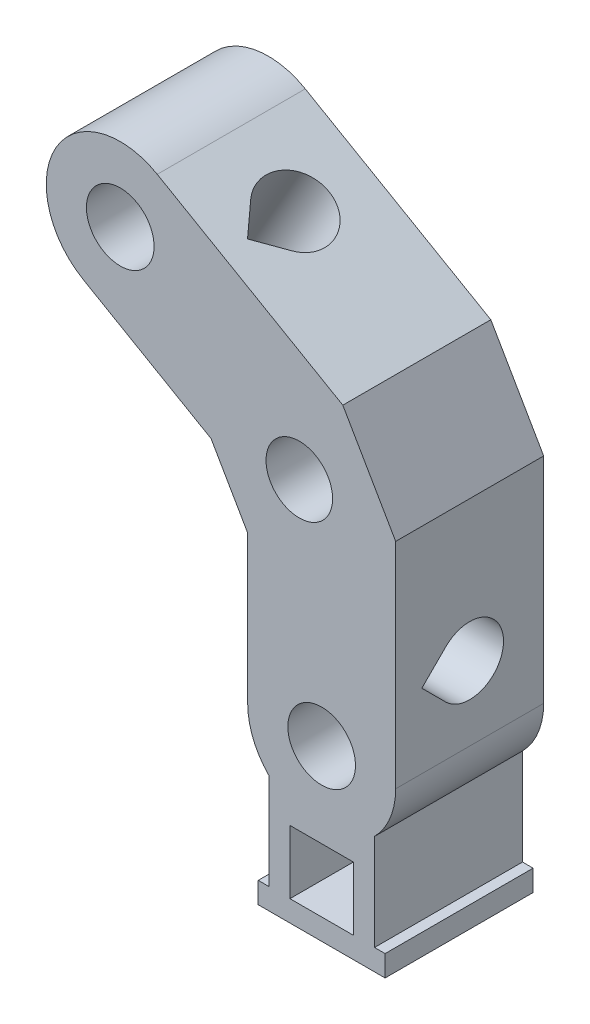
ISO-10303-21;
HEADER;
FILE_DESCRIPTION(('STEP AP214'),'2;1');
FILE_NAME('part.step','',(''),(''),'','','');
FILE_SCHEMA(('AUTOMOTIVE_DESIGN { 1 0 10303 214 1 1 1 1 }'));
ENDSEC;
DATA;
#1=APPLICATION_CONTEXT('core data for automotive mechanical design processes');
#2=APPLICATION_PROTOCOL_DEFINITION('international standard','automotive_design',2000,#1);
#3=PRODUCT_CONTEXT('',#1,'mechanical');
#4=PRODUCT('Part','Part','',(#3));
#5=PRODUCT_RELATED_PRODUCT_CATEGORY('part','',(#4));
#6=PRODUCT_DEFINITION_FORMATION('','',#4);
#7=PRODUCT_DEFINITION_CONTEXT('part definition',#1,'design');
#8=PRODUCT_DEFINITION('design','',#6,#7);
#9=PRODUCT_DEFINITION_SHAPE('','',#8);
#10=(LENGTH_UNIT() NAMED_UNIT(*) SI_UNIT(.MILLI.,.METRE.));
#11=(NAMED_UNIT(*) PLANE_ANGLE_UNIT() SI_UNIT($,.RADIAN.));
#12=(NAMED_UNIT(*) SI_UNIT($,.STERADIAN.) SOLID_ANGLE_UNIT());
#13=UNCERTAINTY_MEASURE_WITH_UNIT(LENGTH_MEASURE(1.E-05),#10,'distance_accuracy_value','');
#14=(GEOMETRIC_REPRESENTATION_CONTEXT(3) GLOBAL_UNCERTAINTY_ASSIGNED_CONTEXT((#13)) GLOBAL_UNIT_ASSIGNED_CONTEXT((#10,
#11,#12)) REPRESENTATION_CONTEXT('',''));
#15=CARTESIAN_POINT('',(0.,0.,0.));
#16=DIRECTION('',(0.,0.,1.));
#17=DIRECTION('',(1.,0.,0.));
#18=AXIS2_PLACEMENT_3D('',#15,#16,#17);
#19=CARTESIAN_POINT('',(1.76670744006513E-13,2.35810055605255E-13,0.));
#20=DIRECTION('',(0.,0.,1.));
#21=DIRECTION('',(1.,0.,0.));
#22=AXIS2_PLACEMENT_3D('',#19,#20,#21);
#23=CYLINDRICAL_SURFACE('',#22,7.);
#24=CARTESIAN_POINT('',(1.76670744006513E-13,2.35810055605255E-13,14.));
#25=DIRECTION('',(0.,0.,1.));
#26=DIRECTION('',(1.,0.,0.));
#27=AXIS2_PLACEMENT_3D('',#24,#25,#26);
#28=CIRCLE('',#27,7.);
#29=CARTESIAN_POINT('',(5.00000000000018,-4.89897948556613,14.));
#30=VERTEX_POINT('',#29);
#31=CARTESIAN_POINT('',(7.00000000000018,2.35810055605255E-13,14.));
#32=VERTEX_POINT('',#31);
#33=EDGE_CURVE('E284',#30,#32,#28,.T.);
#34=ORIENTED_EDGE('',*,*,#33,.F.);
#35=DIRECTION('',(0.,0.,1.));
#36=VECTOR('',#35,1.);
#37=CARTESIAN_POINT('',(5.00000000000018,-4.89897948556613,0.));
#38=LINE('',#37,#36);
#39=CARTESIAN_POINT('',(5.00000000000018,-4.89897948556613,0.));
#40=VERTEX_POINT('',#39);
#41=EDGE_CURVE('E387',#40,#30,#38,.T.);
#42=ORIENTED_EDGE('',*,*,#41,.F.);
#43=CARTESIAN_POINT('',(1.76670744006513E-13,2.35810055605255E-13,0.));
#44=DIRECTION('',(0.,0.,1.));
#45=DIRECTION('',(1.,0.,0.));
#46=AXIS2_PLACEMENT_3D('',#43,#44,#45);
#47=CIRCLE('',#46,7.);
#48=CARTESIAN_POINT('',(7.00000000000018,2.35810055605255E-13,0.));
#49=VERTEX_POINT('',#48);
#50=EDGE_CURVE('E291',#40,#49,#47,.T.);
#51=ORIENTED_EDGE('',*,*,#50,.T.);
#52=DIRECTION('',(0.,0.,1.));
#53=VECTOR('',#52,1.);
#54=CARTESIAN_POINT('',(7.00000000000018,2.35810055605255E-13,0.));
#55=LINE('',#54,#53);
#56=EDGE_CURVE('E340',#49,#32,#55,.T.);
#57=ORIENTED_EDGE('',*,*,#56,.T.);
#58=EDGE_LOOP('',(#34,#42,#51,#57));
#59=FACE_BOUND('',#58,.T.);
#60=ADVANCED_FACE('F30',(#59),#23,.T.);
#61=CARTESIAN_POINT('',(5.00000000000018,-13.9999999999998,0.));
#62=DIRECTION('',(1.,0.,0.));
#63=DIRECTION('',(0.,0.,-1.));
#64=AXIS2_PLACEMENT_3D('',#61,#62,#63);
#65=PLANE('',#64);
#66=DIRECTION('',(0.,1.,0.));
#67=VECTOR('',#66,1.);
#68=CARTESIAN_POINT('',(5.00000000000018,-13.9999999999998,14.));
#69=LINE('',#68,#67);
#70=CARTESIAN_POINT('',(5.00000000000018,-13.9999999999998,14.));
#71=VERTEX_POINT('',#70);
#72=EDGE_CURVE('E295',#71,#30,#69,.T.);
#73=ORIENTED_EDGE('',*,*,#72,.F.);
#74=DIRECTION('',(0.,0.,1.));
#75=VECTOR('',#74,1.);
#76=CARTESIAN_POINT('',(5.00000000000018,-13.9999999999998,0.));
#77=LINE('',#76,#75);
#78=CARTESIAN_POINT('',(5.00000000000018,-13.9999999999998,0.));
#79=VERTEX_POINT('',#78);
#80=EDGE_CURVE('E390',#79,#71,#77,.T.);
#81=ORIENTED_EDGE('',*,*,#80,.F.);
#82=DIRECTION('',(0.,1.,0.));
#83=VECTOR('',#82,1.);
#84=CARTESIAN_POINT('',(5.00000000000018,-13.9999999999998,0.));
#85=LINE('',#84,#83);
#86=EDGE_CURVE('E337',#79,#40,#85,.T.);
#87=ORIENTED_EDGE('',*,*,#86,.T.);
#88=ORIENTED_EDGE('',*,*,#41,.T.);
#89=EDGE_LOOP('',(#73,#81,#87,#88));
#90=FACE_BOUND('',#89,.T.);
#91=ADVANCED_FACE('F450',(#90),#65,.T.);
#92=CARTESIAN_POINT('',(5.00000000000018,-13.9999999999998,0.));
#93=DIRECTION('',(0.,1.,0.));
#94=DIRECTION('',(0.,0.,1.));
#95=AXIS2_PLACEMENT_3D('',#92,#93,#94);
#96=PLANE('',#95);
#97=DIRECTION('',(-1.,0.,0.));
#98=VECTOR('',#97,1.);
#99=CARTESIAN_POINT('',(5.00000000000018,-13.9999999999998,14.));
#100=LINE('',#99,#98);
#101=CARTESIAN_POINT('',(6.00000000000018,-13.9999999999998,14.));
#102=VERTEX_POINT('',#101);
#103=EDGE_CURVE('E382',#102,#71,#100,.T.);
#104=ORIENTED_EDGE('',*,*,#103,.F.);
#105=DIRECTION('',(0.,0.,1.));
#106=VECTOR('',#105,1.);
#107=CARTESIAN_POINT('',(6.00000000000018,-13.9999999999998,0.));
#108=LINE('',#107,#106);
#109=CARTESIAN_POINT('',(6.00000000000018,-13.9999999999998,0.));
#110=VERTEX_POINT('',#109);
#111=EDGE_CURVE('E392',#110,#102,#108,.T.);
#112=ORIENTED_EDGE('',*,*,#111,.F.);
#113=DIRECTION('',(-1.,0.,0.));
#114=VECTOR('',#113,1.);
#115=CARTESIAN_POINT('',(5.00000000000018,-13.9999999999998,0.));
#116=LINE('',#115,#114);
#117=EDGE_CURVE('E334',#110,#79,#116,.T.);
#118=ORIENTED_EDGE('',*,*,#117,.T.);
#119=ORIENTED_EDGE('',*,*,#80,.T.);
#120=EDGE_LOOP('',(#104,#112,#118,#119));
#121=FACE_BOUND('',#120,.T.);
#122=ADVANCED_FACE('F453',(#121),#96,.T.);
#123=CARTESIAN_POINT('',(6.00000000000018,-13.9999999999998,0.));
#124=DIRECTION('',(1.,0.,0.));
#125=DIRECTION('',(0.,0.,-1.));
#126=AXIS2_PLACEMENT_3D('',#123,#124,#125);
#127=PLANE('',#126);
#128=DIRECTION('',(0.,1.,0.));
#129=VECTOR('',#128,1.);
#130=CARTESIAN_POINT('',(6.00000000000018,-13.9999999999998,14.));
#131=LINE('',#130,#129);
#132=CARTESIAN_POINT('',(6.00000000000018,-15.9999999999998,14.));
#133=VERTEX_POINT('',#132);
#134=EDGE_CURVE('E379',#133,#102,#131,.T.);
#135=ORIENTED_EDGE('',*,*,#134,.F.);
#136=DIRECTION('',(0.,0.,1.));
#137=VECTOR('',#136,1.);
#138=CARTESIAN_POINT('',(6.00000000000018,-15.9999999999998,0.));
#139=LINE('',#138,#137);
#140=CARTESIAN_POINT('',(6.00000000000018,-15.9999999999998,0.));
#141=VERTEX_POINT('',#140);
#142=EDGE_CURVE('E394',#141,#133,#139,.T.);
#143=ORIENTED_EDGE('',*,*,#142,.F.);
#144=DIRECTION('',(0.,1.,0.));
#145=VECTOR('',#144,1.);
#146=CARTESIAN_POINT('',(6.00000000000018,-13.9999999999998,0.));
#147=LINE('',#146,#145);
#148=EDGE_CURVE('E331',#141,#110,#147,.T.);
#149=ORIENTED_EDGE('',*,*,#148,.T.);
#150=ORIENTED_EDGE('',*,*,#111,.T.);
#151=EDGE_LOOP('',(#135,#143,#149,#150));
#152=FACE_BOUND('',#151,.T.);
#153=ADVANCED_FACE('F458',(#152),#127,.T.);
#154=CARTESIAN_POINT('',(-5.99999999999982,-15.9999999999998,0.));
#155=DIRECTION('',(0.,-1.,0.));
#156=DIRECTION('',(0.,0.,-1.));
#157=AXIS2_PLACEMENT_3D('',#154,#155,#156);
#158=PLANE('',#157);
#159=DIRECTION('',(1.,0.,0.));
#160=VECTOR('',#159,1.);
#161=CARTESIAN_POINT('',(-5.99999999999982,-15.9999999999998,14.));
#162=LINE('',#161,#160);
#163=CARTESIAN_POINT('',(-5.99999999999982,-15.9999999999998,14.));
#164=VERTEX_POINT('',#163);
#165=EDGE_CURVE('E376',#164,#133,#162,.T.);
#166=ORIENTED_EDGE('',*,*,#165,.F.);
#167=DIRECTION('',(0.,0.,1.));
#168=VECTOR('',#167,1.);
#169=CARTESIAN_POINT('',(-5.99999999999982,-15.9999999999998,0.));
#170=LINE('',#169,#168);
#171=CARTESIAN_POINT('',(-5.99999999999982,-15.9999999999998,0.));
#172=VERTEX_POINT('',#171);
#173=EDGE_CURVE('E396',#172,#164,#170,.T.);
#174=ORIENTED_EDGE('',*,*,#173,.F.);
#175=DIRECTION('',(1.,0.,0.));
#176=VECTOR('',#175,1.);
#177=CARTESIAN_POINT('',(-5.99999999999982,-15.9999999999998,0.));
#178=LINE('',#177,#176);
#179=EDGE_CURVE('E328',#172,#141,#178,.T.);
#180=ORIENTED_EDGE('',*,*,#179,.T.);
#181=ORIENTED_EDGE('',*,*,#142,.T.);
#182=EDGE_LOOP('',(#166,#174,#180,#181));
#183=FACE_BOUND('',#182,.T.);
#184=ADVANCED_FACE('F461',(#183),#158,.T.);
#185=CARTESIAN_POINT('',(-5.99999999999982,-13.9999999999998,0.));
#186=DIRECTION('',(-1.,0.,0.));
#187=DIRECTION('',(0.,0.,1.));
#188=AXIS2_PLACEMENT_3D('',#185,#186,#187);
#189=PLANE('',#188);
#190=DIRECTION('',(0.,-1.,0.));
#191=VECTOR('',#190,1.);
#192=CARTESIAN_POINT('',(-5.99999999999982,-13.9999999999998,14.));
#193=LINE('',#192,#191);
#194=CARTESIAN_POINT('',(-5.99999999999982,-13.9999999999998,14.));
#195=VERTEX_POINT('',#194);
#196=EDGE_CURVE('E373',#195,#164,#193,.T.);
#197=ORIENTED_EDGE('',*,*,#196,.F.);
#198=DIRECTION('',(0.,0.,1.));
#199=VECTOR('',#198,1.);
#200=CARTESIAN_POINT('',(-5.99999999999982,-13.9999999999998,0.));
#201=LINE('',#200,#199);
#202=CARTESIAN_POINT('',(-5.99999999999982,-13.9999999999998,0.));
#203=VERTEX_POINT('',#202);
#204=EDGE_CURVE('E398',#203,#195,#201,.T.);
#205=ORIENTED_EDGE('',*,*,#204,.F.);
#206=DIRECTION('',(0.,-1.,0.));
#207=VECTOR('',#206,1.);
#208=CARTESIAN_POINT('',(-5.99999999999982,-13.9999999999998,0.));
#209=LINE('',#208,#207);
#210=EDGE_CURVE('E325',#203,#172,#209,.T.);
#211=ORIENTED_EDGE('',*,*,#210,.T.);
#212=ORIENTED_EDGE('',*,*,#173,.T.);
#213=EDGE_LOOP('',(#197,#205,#211,#212));
#214=FACE_BOUND('',#213,.T.);
#215=ADVANCED_FACE('F466',(#214),#189,.T.);
#216=CARTESIAN_POINT('',(-5.99999999999982,-13.9999999999998,0.));
#217=DIRECTION('',(0.,1.,0.));
#218=DIRECTION('',(-1.,0.,0.));
#219=AXIS2_PLACEMENT_3D('',#216,#217,#218);
#220=PLANE('',#219);
#221=DIRECTION('',(-1.,0.,0.));
#222=VECTOR('',#221,1.);
#223=CARTESIAN_POINT('',(-5.99999999999982,-13.9999999999998,14.));
#224=LINE('',#223,#222);
#225=CARTESIAN_POINT('',(-4.99999999999982,-13.9999999999998,14.));
#226=VERTEX_POINT('',#225);
#227=EDGE_CURVE('E370',#226,#195,#224,.T.);
#228=ORIENTED_EDGE('',*,*,#227,.F.);
#229=DIRECTION('',(0.,0.,1.));
#230=VECTOR('',#229,1.);
#231=CARTESIAN_POINT('',(-4.99999999999982,-13.9999999999998,0.));
#232=LINE('',#231,#230);
#233=CARTESIAN_POINT('',(-4.99999999999982,-13.9999999999998,0.));
#234=VERTEX_POINT('',#233);
#235=EDGE_CURVE('E400',#234,#226,#232,.T.);
#236=ORIENTED_EDGE('',*,*,#235,.F.);
#237=DIRECTION('',(-1.,0.,0.));
#238=VECTOR('',#237,1.);
#239=CARTESIAN_POINT('',(-5.99999999999982,-13.9999999999998,0.));
#240=LINE('',#239,#238);
#241=EDGE_CURVE('E322',#234,#203,#240,.T.);
#242=ORIENTED_EDGE('',*,*,#241,.T.);
#243=ORIENTED_EDGE('',*,*,#204,.T.);
#244=EDGE_LOOP('',(#228,#236,#242,#243));
#245=FACE_BOUND('',#244,.T.);
#246=ADVANCED_FACE('F469',(#245),#220,.T.);
#247=CARTESIAN_POINT('',(-4.99999999999982,-13.9999999999998,0.));
#248=DIRECTION('',(-1.,0.,0.));
#249=DIRECTION('',(0.,0.,1.));
#250=AXIS2_PLACEMENT_3D('',#247,#248,#249);
#251=PLANE('',#250);
#252=DIRECTION('',(0.,-1.,0.));
#253=VECTOR('',#252,1.);
#254=CARTESIAN_POINT('',(-4.99999999999982,-13.9999999999998,14.));
#255=LINE('',#254,#253);
#256=CARTESIAN_POINT('',(-4.99999999999982,-4.89897948556613,14.));
#257=VERTEX_POINT('',#256);
#258=EDGE_CURVE('E367',#257,#226,#255,.T.);
#259=ORIENTED_EDGE('',*,*,#258,.F.);
#260=DIRECTION('',(0.,0.,1.));
#261=VECTOR('',#260,1.);
#262=CARTESIAN_POINT('',(-4.99999999999982,-4.89897948556613,0.));
#263=LINE('',#262,#261);
#264=CARTESIAN_POINT('',(-4.99999999999982,-4.89897948556613,0.));
#265=VERTEX_POINT('',#264);
#266=EDGE_CURVE('E402',#265,#257,#263,.T.);
#267=ORIENTED_EDGE('',*,*,#266,.F.);
#268=DIRECTION('',(0.,-1.,0.));
#269=VECTOR('',#268,1.);
#270=CARTESIAN_POINT('',(-4.99999999999982,-13.9999999999998,0.));
#271=LINE('',#270,#269);
#272=EDGE_CURVE('E319',#265,#234,#271,.T.);
#273=ORIENTED_EDGE('',*,*,#272,.T.);
#274=ORIENTED_EDGE('',*,*,#235,.T.);
#275=EDGE_LOOP('',(#259,#267,#273,#274));
#276=FACE_BOUND('',#275,.T.);
#277=ADVANCED_FACE('F474',(#276),#251,.T.);
#278=CARTESIAN_POINT('',(1.76670744006513E-13,2.35810055605255E-13,0.));
#279=DIRECTION('',(0.,0.,1.));
#280=DIRECTION('',(1.,0.,0.));
#281=AXIS2_PLACEMENT_3D('',#278,#279,#280);
#282=CYLINDRICAL_SURFACE('',#281,7.);
#283=CARTESIAN_POINT('',(1.76670744006513E-13,2.35810055605255E-13,14.));
#284=DIRECTION('',(0.,0.,1.));
#285=DIRECTION('',(1.,0.,0.));
#286=AXIS2_PLACEMENT_3D('',#283,#284,#285);
#287=CIRCLE('',#286,7.);
#288=CARTESIAN_POINT('',(-6.99999999999982,2.35810055605255E-13,14.));
#289=VERTEX_POINT('',#288);
#290=EDGE_CURVE('E364',#289,#257,#287,.T.);
#291=ORIENTED_EDGE('',*,*,#290,.F.);
#292=DIRECTION('',(0.,0.,1.));
#293=VECTOR('',#292,1.);
#294=CARTESIAN_POINT('',(-6.99999999999982,2.35810055605255E-13,0.));
#295=LINE('',#294,#293);
#296=CARTESIAN_POINT('',(-6.99999999999982,2.35810055605255E-13,0.));
#297=VERTEX_POINT('',#296);
#298=EDGE_CURVE('E404',#297,#289,#295,.T.);
#299=ORIENTED_EDGE('',*,*,#298,.F.);
#300=CARTESIAN_POINT('',(1.76670744006513E-13,2.35810055605255E-13,0.));
#301=DIRECTION('',(0.,0.,1.));
#302=DIRECTION('',(1.,0.,0.));
#303=AXIS2_PLACEMENT_3D('',#300,#301,#302);
#304=CIRCLE('',#303,7.);
#305=EDGE_CURVE('E316',#297,#265,#304,.T.);
#306=ORIENTED_EDGE('',*,*,#305,.T.);
#307=ORIENTED_EDGE('',*,*,#266,.T.);
#308=EDGE_LOOP('',(#291,#299,#306,#307));
#309=FACE_BOUND('',#308,.T.);
#310=ADVANCED_FACE('F477',(#309),#282,.T.);
#311=CARTESIAN_POINT('',(-6.9999999999999,13.9585481156721,0.));
#312=DIRECTION('',(-1.,0.,0.));
#313=DIRECTION('',(0.,-1.,0.));
#314=AXIS2_PLACEMENT_3D('',#311,#312,#313);
#315=PLANE('',#314);
#316=CARTESIAN_POINT('',(-6.99999999999982,6.99999999999971,7.));
#317=DIRECTION('',(-1.,0.,0.));
#318=DIRECTION('',(0.,-1.,0.));
#319=AXIS2_PLACEMENT_3D('',#316,#317,#318);
#320=CIRCLE('',#319,3.2);
#321=CARTESIAN_POINT('',(-6.99999999999982,9.26274169979667,9.26274169979694));
#322=VERTEX_POINT('',#321);
#323=CARTESIAN_POINT('',(-6.99999999999985,4.73725830020277,9.26274169979697));
#324=VERTEX_POINT('',#323);
#325=EDGE_CURVE('E221',#322,#324,#320,.T.);
#326=ORIENTED_EDGE('',*,*,#325,.F.);
#327=DIRECTION('',(0.,0.707106781186543,-0.707106781186552));
#328=VECTOR('',#327,1.);
#329=CARTESIAN_POINT('',(-6.99999999999982,6.99999999999973,11.5254833995939));
#330=LINE('',#329,#328);
#331=CARTESIAN_POINT('',(-6.99999999999982,6.99999999999973,11.5254833995939));
#332=VERTEX_POINT('',#331);
#333=EDGE_CURVE('E227',#332,#322,#330,.T.);
#334=ORIENTED_EDGE('',*,*,#333,.F.);
#335=DIRECTION('',(0.,0.707106781186551,0.707106781186544));
#336=VECTOR('',#335,1.);
#337=CARTESIAN_POINT('',(-6.99999999999982,4.73725830020277,9.26274169979697));
#338=LINE('',#337,#336);
#339=EDGE_CURVE('E235',#324,#332,#338,.T.);
#340=ORIENTED_EDGE('',*,*,#339,.F.);
#341=EDGE_LOOP('',(#326,#334,#340));
#342=FACE_BOUND('',#341,.T.);
#343=DIRECTION('',(0.,-1.,0.));
#344=VECTOR('',#343,1.);
#345=CARTESIAN_POINT('',(-6.9999999999999,13.9585481156721,14.));
#346=LINE('',#345,#344);
#347=CARTESIAN_POINT('',(-6.9999999999999,13.9585481156721,14.));
#348=VERTEX_POINT('',#347);
#349=EDGE_CURVE('E361',#348,#289,#346,.T.);
#350=ORIENTED_EDGE('',*,*,#349,.F.);
#351=DIRECTION('',(0.,0.,1.));
#352=VECTOR('',#351,1.);
#353=CARTESIAN_POINT('',(-6.9999999999999,13.9585481156721,0.));
#354=LINE('',#353,#352);
#355=CARTESIAN_POINT('',(-6.9999999999999,13.9585481156721,0.));
#356=VERTEX_POINT('',#355);
#357=EDGE_CURVE('E406',#356,#348,#354,.T.);
#358=ORIENTED_EDGE('',*,*,#357,.F.);
#359=DIRECTION('',(0.,-1.,0.));
#360=VECTOR('',#359,1.);
#361=CARTESIAN_POINT('',(-6.9999999999999,13.9585481156721,0.));
#362=LINE('',#361,#360);
#363=EDGE_CURVE('E313',#356,#297,#362,.T.);
#364=ORIENTED_EDGE('',*,*,#363,.T.);
#365=ORIENTED_EDGE('',*,*,#298,.T.);
#366=EDGE_LOOP('',(#350,#358,#364,#365));
#367=FACE_BOUND('',#366,.T.);
#368=ADVANCED_FACE('F482',(#342,#367),#315,.T.);
#369=CARTESIAN_POINT('',(-10.4641016151382,19.9585481156731,0.));
#370=DIRECTION('',(-0.866025403784438,-0.5,0.));
#371=DIRECTION('',(0.5,-0.866025403784439,0.));
#372=AXIS2_PLACEMENT_3D('',#369,#370,#371);
#373=PLANE('',#372);
#374=DIRECTION('',(0.5,-0.866025403784438,0.));
#375=VECTOR('',#374,1.);
#376=CARTESIAN_POINT('',(-10.4641016151382,19.9585481156731,14.));
#377=LINE('',#376,#375);
#378=CARTESIAN_POINT('',(-10.4641016151382,19.9585481156731,14.));
#379=VERTEX_POINT('',#378);
#380=EDGE_CURVE('E358',#379,#348,#377,.T.);
#381=ORIENTED_EDGE('',*,*,#380,.F.);
#382=DIRECTION('',(0.,0.,1.));
#383=VECTOR('',#382,1.);
#384=CARTESIAN_POINT('',(-10.4641016151382,19.9585481156731,0.));
#385=LINE('',#384,#383);
#386=CARTESIAN_POINT('',(-10.4641016151382,19.9585481156731,0.));
#387=VERTEX_POINT('',#386);
#388=EDGE_CURVE('E408',#387,#379,#385,.T.);
#389=ORIENTED_EDGE('',*,*,#388,.F.);
#390=DIRECTION('',(0.5,-0.866025403784438,0.));
#391=VECTOR('',#390,1.);
#392=CARTESIAN_POINT('',(-10.4641016151382,19.9585481156731,0.));
#393=LINE('',#392,#391);
#394=EDGE_CURVE('E310',#387,#356,#393,.T.);
#395=ORIENTED_EDGE('',*,*,#394,.T.);
#396=ORIENTED_EDGE('',*,*,#357,.T.);
#397=EDGE_LOOP('',(#381,#389,#395,#396));
#398=FACE_BOUND('',#397,.T.);
#399=ADVANCED_FACE('F485',(#398),#373,.T.);
#400=CARTESIAN_POINT('',(-22.5525588832574,26.9378221735091,0.));
#401=DIRECTION('',(-0.500000000000008,-0.866025403784434,0.));
#402=DIRECTION('',(0.866025403784434,-0.500000000000008,0.));
#403=AXIS2_PLACEMENT_3D('',#400,#401,#402);
#404=PLANE('',#403);
#405=DIRECTION('',(-0.612372435695793,0.353553390593272,0.707106781186549));
#406=VECTOR('',#405,1.);
#407=CARTESIAN_POINT('',(-14.5307009376536,22.3064003292134,9.26274169979695));
#408=LINE('',#407,#406);
#409=CARTESIAN_POINT('',(-14.5307009376536,22.3064003292134,9.26274169979695));
#410=VERTEX_POINT('',#409);
#411=CARTESIAN_POINT('',(-16.49029273188,23.4377711791121,11.5254833995939));
#412=VERTEX_POINT('',#411);
#413=EDGE_CURVE('E44',#410,#412,#408,.T.);
#414=ORIENTED_EDGE('',*,*,#413,.F.);
#415=CARTESIAN_POINT('',(-16.4902927318801,23.4377711791119,7.));
#416=DIRECTION('',(-0.499999999999998,-0.86602540378444,0.));
#417=DIRECTION('',(0.86602540378444,-0.499999999999998,0.));
#418=AXIS2_PLACEMENT_3D('',#415,#416,#417);
#419=CIRCLE('',#418,3.2);
#420=CARTESIAN_POINT('',(-18.4498845261067,24.5691420290104,9.26274169979695));
#421=VERTEX_POINT('',#420);
#422=EDGE_CURVE('E204',#421,#410,#419,.T.);
#423=ORIENTED_EDGE('',*,*,#422,.F.);
#424=DIRECTION('',(-0.612372435695796,0.353553390593272,-0.707106781186547));
#425=VECTOR('',#424,1.);
#426=CARTESIAN_POINT('',(-16.4902927318801,23.4377711791119,11.5254833995939));
#427=LINE('',#426,#425);
#428=EDGE_CURVE('E211',#412,#421,#427,.T.);
#429=ORIENTED_EDGE('',*,*,#428,.F.);
#430=EDGE_LOOP('',(#414,#423,#429));
#431=FACE_BOUND('',#430,.T.);
#432=DIRECTION('',(0.866025403784434,-0.500000000000008,0.));
#433=VECTOR('',#432,1.);
#434=CARTESIAN_POINT('',(-22.5525588832574,26.9378221735091,14.));
#435=LINE('',#434,#433);
#436=CARTESIAN_POINT('',(-22.5525588832574,26.9378221735091,14.));
#437=VERTEX_POINT('',#436);
#438=EDGE_CURVE('E355',#437,#379,#435,.T.);
#439=ORIENTED_EDGE('',*,*,#438,.F.);
#440=DIRECTION('',(0.,0.,1.));
#441=VECTOR('',#440,1.);
#442=CARTESIAN_POINT('',(-22.5525588832574,26.9378221735091,0.));
#443=LINE('',#442,#441);
#444=CARTESIAN_POINT('',(-22.5525588832574,26.9378221735091,0.));
#445=VERTEX_POINT('',#444);
#446=EDGE_CURVE('E410',#445,#437,#443,.T.);
#447=ORIENTED_EDGE('',*,*,#446,.F.);
#448=DIRECTION('',(0.866025403784434,-0.500000000000008,0.));
#449=VECTOR('',#448,1.);
#450=CARTESIAN_POINT('',(-22.5525588832574,26.9378221735091,0.));
#451=LINE('',#450,#449);
#452=EDGE_CURVE('E307',#445,#387,#451,.T.);
#453=ORIENTED_EDGE('',*,*,#452,.T.);
#454=ORIENTED_EDGE('',*,*,#388,.T.);
#455=EDGE_LOOP('',(#439,#447,#453,#454));
#456=FACE_BOUND('',#455,.T.);
#457=ADVANCED_FACE('F215',(#431,#456),#404,.T.);
#458=CARTESIAN_POINT('',(-19.0525588832574,33.0000000000002,0.));
#459=DIRECTION('',(0.,0.,1.));
#460=DIRECTION('',(1.,0.,0.));
#461=AXIS2_PLACEMENT_3D('',#458,#459,#460);
#462=CYLINDRICAL_SURFACE('',#461,7.00000000000001);
#463=CARTESIAN_POINT('',(-19.0525588832574,33.0000000000002,14.));
#464=DIRECTION('',(0.,0.,1.));
#465=DIRECTION('',(1.,0.,0.));
#466=AXIS2_PLACEMENT_3D('',#463,#464,#465);
#467=CIRCLE('',#466,7.00000000000001);
#468=CARTESIAN_POINT('',(-15.5525588832575,39.0621778264913,14.));
#469=VERTEX_POINT('',#468);
#470=EDGE_CURVE('E352',#469,#437,#467,.T.);
#471=ORIENTED_EDGE('',*,*,#470,.F.);
#472=DIRECTION('',(0.,0.,1.));
#473=VECTOR('',#472,1.);
#474=CARTESIAN_POINT('',(-15.5525588832575,39.0621778264913,0.));
#475=LINE('',#474,#473);
#476=CARTESIAN_POINT('',(-15.5525588832575,39.0621778264913,0.));
#477=VERTEX_POINT('',#476);
#478=EDGE_CURVE('E412',#477,#469,#475,.T.);
#479=ORIENTED_EDGE('',*,*,#478,.F.);
#480=CARTESIAN_POINT('',(-19.0525588832574,33.0000000000002,0.));
#481=DIRECTION('',(0.,0.,1.));
#482=DIRECTION('',(1.,0.,0.));
#483=AXIS2_PLACEMENT_3D('',#480,#481,#482);
#484=CIRCLE('',#483,7.00000000000001);
#485=EDGE_CURVE('E304',#477,#445,#484,.T.);
#486=ORIENTED_EDGE('',*,*,#485,.T.);
#487=ORIENTED_EDGE('',*,*,#446,.T.);
#488=EDGE_LOOP('',(#471,#479,#486,#487));
#489=FACE_BOUND('',#488,.T.);
#490=ADVANCED_FACE('F426',(#489),#462,.T.);
#491=CARTESIAN_POINT('',(2.00000000000025,28.9282032302758,0.));
#492=DIRECTION('',(0.499999999999997,0.866025403784441,0.));
#493=DIRECTION('',(-0.866025403784441,0.499999999999997,0.));
#494=AXIS2_PLACEMENT_3D('',#491,#492,#493);
#495=PLANE('',#494);
#496=DIRECTION('',(0.612372435695794,-0.353553390593271,-0.707106781186549));
#497=VECTOR('',#496,1.);
#498=CARTESIAN_POINT('',(1.24553434153221,29.3637941812867,-0.871181902021696));
#499=LINE('',#498,#497);
#500=CARTESIAN_POINT('',(-9.49029273187996,35.5621268320944,11.5254833995939));
#501=VERTEX_POINT('',#500);
#502=CARTESIAN_POINT('',(-7.53070093765342,34.4307559821959,9.26274169979695));
#503=VERTEX_POINT('',#502);
#504=EDGE_CURVE('E11',#501,#503,#499,.T.);
#505=ORIENTED_EDGE('',*,*,#504,.F.);
#506=DIRECTION('',(0.612372435695796,-0.353553390593272,0.707106781186547));
#507=VECTOR('',#506,1.);
#508=CARTESIAN_POINT('',(-8.73582707341194,35.1265358810836,12.3966653016156));
#509=LINE('',#508,#507);
#510=CARTESIAN_POINT('',(-11.4498845261065,36.6934976819929,9.26274169979695));
#511=VERTEX_POINT('',#510);
#512=EDGE_CURVE('E389',#511,#501,#509,.T.);
#513=ORIENTED_EDGE('',*,*,#512,.F.);
#514=CARTESIAN_POINT('',(-9.49029273187997,35.5621268320944,7.));
#515=DIRECTION('',(0.499999999999997,0.866025403784441,0.));
#516=DIRECTION('',(-0.866025403784441,0.499999999999997,0.));
#517=AXIS2_PLACEMENT_3D('',#514,#515,#516);
#518=CIRCLE('',#517,3.2);
#519=EDGE_CURVE('E37',#503,#511,#518,.T.);
#520=ORIENTED_EDGE('',*,*,#519,.F.);
#521=EDGE_LOOP('',(#505,#513,#520));
#522=FACE_BOUND('',#521,.T.);
#523=DIRECTION('',(-0.866025403784441,0.499999999999997,0.));
#524=VECTOR('',#523,1.);
#525=CARTESIAN_POINT('',(2.00000000000025,28.9282032302758,14.));
#526=LINE('',#525,#524);
#527=CARTESIAN_POINT('',(2.00000000000025,28.9282032302758,14.));
#528=VERTEX_POINT('',#527);
#529=EDGE_CURVE('E349',#528,#469,#526,.T.);
#530=ORIENTED_EDGE('',*,*,#529,.F.);
#531=DIRECTION('',(0.,0.,1.));
#532=VECTOR('',#531,1.);
#533=CARTESIAN_POINT('',(2.00000000000025,28.9282032302758,0.));
#534=LINE('',#533,#532);
#535=CARTESIAN_POINT('',(2.00000000000025,28.9282032302758,0.));
#536=VERTEX_POINT('',#535);
#537=EDGE_CURVE('E414',#536,#528,#534,.T.);
#538=ORIENTED_EDGE('',*,*,#537,.F.);
#539=DIRECTION('',(-0.866025403784441,0.499999999999997,0.));
#540=VECTOR('',#539,1.);
#541=CARTESIAN_POINT('',(2.00000000000025,28.9282032302758,0.));
#542=LINE('',#541,#540);
#543=EDGE_CURVE('E301',#536,#477,#542,.T.);
#544=ORIENTED_EDGE('',*,*,#543,.T.);
#545=ORIENTED_EDGE('',*,*,#478,.T.);
#546=EDGE_LOOP('',(#530,#538,#544,#545));
#547=FACE_BOUND('',#546,.T.);
#548=ADVANCED_FACE('F422',(#522,#547),#495,.T.);
#549=CARTESIAN_POINT('',(7.00000000000016,20.2679491924314,0.));
#550=DIRECTION('',(0.866025403784444,0.499999999999991,0.));
#551=DIRECTION('',(-0.499999999999991,0.866025403784444,0.));
#552=AXIS2_PLACEMENT_3D('',#549,#550,#551);
#553=PLANE('',#552);
#554=DIRECTION('',(-0.499999999999991,0.866025403784444,0.));
#555=VECTOR('',#554,1.);
#556=CARTESIAN_POINT('',(7.00000000000016,20.2679491924314,14.));
#557=LINE('',#556,#555);
#558=CARTESIAN_POINT('',(7.00000000000016,20.2679491924314,14.));
#559=VERTEX_POINT('',#558);
#560=EDGE_CURVE('E346',#559,#528,#557,.T.);
#561=ORIENTED_EDGE('',*,*,#560,.F.);
#562=DIRECTION('',(0.,0.,1.));
#563=VECTOR('',#562,1.);
#564=CARTESIAN_POINT('',(7.00000000000016,20.2679491924314,0.));
#565=LINE('',#564,#563);
#566=CARTESIAN_POINT('',(7.00000000000016,20.2679491924314,0.));
#567=VERTEX_POINT('',#566);
#568=EDGE_CURVE('E416',#567,#559,#565,.T.);
#569=ORIENTED_EDGE('',*,*,#568,.F.);
#570=DIRECTION('',(-0.499999999999991,0.866025403784444,0.));
#571=VECTOR('',#570,1.);
#572=CARTESIAN_POINT('',(7.00000000000016,20.2679491924314,0.));
#573=LINE('',#572,#571);
#574=EDGE_CURVE('E298',#567,#536,#573,.T.);
#575=ORIENTED_EDGE('',*,*,#574,.T.);
#576=ORIENTED_EDGE('',*,*,#537,.T.);
#577=EDGE_LOOP('',(#561,#569,#575,#576));
#578=FACE_BOUND('',#577,.T.);
#579=ADVANCED_FACE('F425',(#578),#553,.T.);
#580=CARTESIAN_POINT('',(7.00000000000018,2.35810055605255E-13,0.));
#581=DIRECTION('',(1.,0.,0.));
#582=DIRECTION('',(0.,1.,0.));
#583=AXIS2_PLACEMENT_3D('',#580,#581,#582);
#584=PLANE('',#583);
#585=CARTESIAN_POINT('',(7.00000000000018,6.99999999999971,7.));
#586=DIRECTION('',(-1.,0.,0.));
#587=DIRECTION('',(0.,-1.,0.));
#588=AXIS2_PLACEMENT_3D('',#585,#586,#587);
#589=CIRCLE('',#588,3.2);
#590=CARTESIAN_POINT('',(7.00000000000018,9.26274169979667,9.26274169979694));
#591=VERTEX_POINT('',#590);
#592=CARTESIAN_POINT('',(7.00000000000018,4.73725830020277,9.26274169979697));
#593=VERTEX_POINT('',#592);
#594=EDGE_CURVE('E223',#591,#593,#589,.T.);
#595=ORIENTED_EDGE('',*,*,#594,.T.);
#596=DIRECTION('',(0.,0.707106781186551,0.707106781186544));
#597=VECTOR('',#596,1.);
#598=CARTESIAN_POINT('',(7.00000000000018,4.73725830020277,9.26274169979697));
#599=LINE('',#598,#597);
#600=CARTESIAN_POINT('',(7.00000000000017,6.99999999999973,11.5254833995939));
#601=VERTEX_POINT('',#600);
#602=EDGE_CURVE('E226',#593,#601,#599,.T.);
#603=ORIENTED_EDGE('',*,*,#602,.T.);
#604=DIRECTION('',(0.,0.707106781186543,-0.707106781186552));
#605=VECTOR('',#604,1.);
#606=CARTESIAN_POINT('',(7.00000000000018,6.99999999999973,11.5254833995939));
#607=LINE('',#606,#605);
#608=EDGE_CURVE('E230',#601,#591,#607,.T.);
#609=ORIENTED_EDGE('',*,*,#608,.T.);
#610=EDGE_LOOP('',(#595,#603,#609));
#611=FACE_BOUND('',#610,.T.);
#612=DIRECTION('',(0.,1.,0.));
#613=VECTOR('',#612,1.);
#614=CARTESIAN_POINT('',(7.00000000000018,2.35810055605255E-13,14.));
#615=LINE('',#614,#613);
#616=EDGE_CURVE('E343',#32,#559,#615,.T.);
#617=ORIENTED_EDGE('',*,*,#616,.F.);
#618=ORIENTED_EDGE('',*,*,#56,.F.);
#619=DIRECTION('',(0.,1.,0.));
#620=VECTOR('',#619,1.);
#621=CARTESIAN_POINT('',(7.00000000000018,2.35810055605255E-13,0.));
#622=LINE('',#621,#620);
#623=EDGE_CURVE('E294',#49,#567,#622,.T.);
#624=ORIENTED_EDGE('',*,*,#623,.T.);
#625=ORIENTED_EDGE('',*,*,#568,.T.);
#626=EDGE_LOOP('',(#617,#618,#624,#625));
#627=FACE_BOUND('',#626,.T.);
#628=ADVANCED_FACE('F443',(#611,#627),#584,.T.);
#629=CARTESIAN_POINT('',(1.76670744006513E-13,2.35810055605255E-13,0.));
#630=DIRECTION('',(0.,0.,1.));
#631=DIRECTION('',(1.,0.,0.));
#632=AXIS2_PLACEMENT_3D('',#629,#630,#631);
#633=PLANE('',#632);
#634=CARTESIAN_POINT('',(-2.11602540378443,20.7783121635131,0.));
#635=DIRECTION('',(0.,0.,1.));
#636=DIRECTION('',(1.,0.,0.));
#637=AXIS2_PLACEMENT_3D('',#634,#635,#636);
#638=CIRCLE('',#637,3.15);
#639=CARTESIAN_POINT('',(1.03397459621557,20.7783121635131,0.));
#640=VERTEX_POINT('',#639);
#641=EDGE_CURVE('E786',#640,#640,#638,.T.);
#642=ORIENTED_EDGE('',*,*,#641,.T.);
#643=EDGE_LOOP('',(#642));
#644=FACE_BOUND('',#643,.T.);
#645=CARTESIAN_POINT('',(0.,0.,0.));
#646=DIRECTION('',(0.,0.,-1.));
#647=DIRECTION('',(-1.,0.,0.));
#648=AXIS2_PLACEMENT_3D('',#645,#646,#647);
#649=CIRCLE('',#648,3.20000000000001);
#650=CARTESIAN_POINT('',(-3.20000000000001,0.,0.));
#651=VERTEX_POINT('',#650);
#652=EDGE_CURVE('E242',#651,#651,#649,.T.);
#653=ORIENTED_EDGE('',*,*,#652,.F.);
#654=EDGE_LOOP('',(#653));
#655=FACE_BOUND('',#654,.T.);
#656=CARTESIAN_POINT('',(-19.0525,32.999898011206,0.));
#657=DIRECTION('',(0.,0.,-1.));
#658=DIRECTION('',(-1.,0.,0.));
#659=AXIS2_PLACEMENT_3D('',#656,#657,#658);
#660=CIRCLE('',#659,3.20000000000002);
#661=CARTESIAN_POINT('',(-22.2525000000001,32.999898011206,0.));
#662=VERTEX_POINT('',#661);
#663=EDGE_CURVE('E252',#662,#662,#660,.T.);
#664=ORIENTED_EDGE('',*,*,#663,.F.);
#665=EDGE_LOOP('',(#664));
#666=FACE_BOUND('',#665,.T.);
#667=DIRECTION('',(-1.,0.,0.));
#668=VECTOR('',#667,1.);
#669=CARTESIAN_POINT('',(-2.99999999999982,-7.99999999999976,0.));
#670=LINE('',#669,#668);
#671=CARTESIAN_POINT('',(3.00000000000018,-7.99999999999976,0.));
#672=VERTEX_POINT('',#671);
#673=CARTESIAN_POINT('',(-2.99999999999982,-7.99999999999976,0.));
#674=VERTEX_POINT('',#673);
#675=EDGE_CURVE('E269',#672,#674,#670,.T.);
#676=ORIENTED_EDGE('',*,*,#675,.T.);
#677=DIRECTION('',(0.,-1.,0.));
#678=VECTOR('',#677,1.);
#679=CARTESIAN_POINT('',(-2.99999999999982,-13.9999999999998,0.));
#680=LINE('',#679,#678);
#681=CARTESIAN_POINT('',(-2.99999999999982,-13.9999999999998,0.));
#682=VERTEX_POINT('',#681);
#683=EDGE_CURVE('E259',#674,#682,#680,.T.);
#684=ORIENTED_EDGE('',*,*,#683,.T.);
#685=DIRECTION('',(1.,0.,0.));
#686=VECTOR('',#685,1.);
#687=CARTESIAN_POINT('',(-2.99999999999982,-13.9999999999998,0.));
#688=LINE('',#687,#686);
#689=CARTESIAN_POINT('',(3.00000000000018,-13.9999999999998,0.));
#690=VERTEX_POINT('',#689);
#691=EDGE_CURVE('E262',#682,#690,#688,.T.);
#692=ORIENTED_EDGE('',*,*,#691,.T.);
#693=DIRECTION('',(0.,1.,0.));
#694=VECTOR('',#693,1.);
#695=CARTESIAN_POINT('',(3.00000000000018,-13.9999999999998,0.));
#696=LINE('',#695,#694);
#697=EDGE_CURVE('E266',#690,#672,#696,.T.);
#698=ORIENTED_EDGE('',*,*,#697,.T.);
#699=EDGE_LOOP('',(#676,#684,#692,#698));
#700=FACE_BOUND('',#699,.T.);
#701=ORIENTED_EDGE('',*,*,#50,.F.);
#702=ORIENTED_EDGE('',*,*,#86,.F.);
#703=ORIENTED_EDGE('',*,*,#117,.F.);
#704=ORIENTED_EDGE('',*,*,#148,.F.);
#705=ORIENTED_EDGE('',*,*,#179,.F.);
#706=ORIENTED_EDGE('',*,*,#210,.F.);
#707=ORIENTED_EDGE('',*,*,#241,.F.);
#708=ORIENTED_EDGE('',*,*,#272,.F.);
#709=ORIENTED_EDGE('',*,*,#305,.F.);
#710=ORIENTED_EDGE('',*,*,#363,.F.);
#711=ORIENTED_EDGE('',*,*,#394,.F.);
#712=ORIENTED_EDGE('',*,*,#452,.F.);
#713=ORIENTED_EDGE('',*,*,#485,.F.);
#714=ORIENTED_EDGE('',*,*,#543,.F.);
#715=ORIENTED_EDGE('',*,*,#574,.F.);
#716=ORIENTED_EDGE('',*,*,#623,.F.);
#717=EDGE_LOOP('',(#701,#702,#703,#704,#705,#706,#707,#708,#709,#710,#711,#712,#713,#714,#715,#716));
#718=FACE_BOUND('',#717,.T.);
#719=ADVANCED_FACE('F440',(#644,#655,#666,#700,#718),#633,.F.);
#720=CARTESIAN_POINT('',(1.76670744006513E-13,2.35810055605255E-13,14.));
#721=DIRECTION('',(0.,0.,1.));
#722=DIRECTION('',(1.,0.,0.));
#723=AXIS2_PLACEMENT_3D('',#720,#721,#722);
#724=PLANE('',#723);
#725=CARTESIAN_POINT('',(-2.11602540378443,20.7783121635131,14.));
#726=DIRECTION('',(0.,0.,1.));
#727=DIRECTION('',(1.,0.,0.));
#728=AXIS2_PLACEMENT_3D('',#725,#726,#727);
#729=CIRCLE('',#728,3.15);
#730=CARTESIAN_POINT('',(1.03397459621557,20.7783121635131,14.));
#731=VERTEX_POINT('',#730);
#732=EDGE_CURVE('E789',#731,#731,#729,.T.);
#733=ORIENTED_EDGE('',*,*,#732,.F.);
#734=EDGE_LOOP('',(#733));
#735=FACE_BOUND('',#734,.T.);
#736=CARTESIAN_POINT('',(0.,0.,14.));
#737=DIRECTION('',(0.,0.,-1.));
#738=DIRECTION('',(-1.,0.,0.));
#739=AXIS2_PLACEMENT_3D('',#736,#737,#738);
#740=CIRCLE('',#739,3.20000000000001);
#741=CARTESIAN_POINT('',(-3.20000000000001,0.,14.));
#742=VERTEX_POINT('',#741);
#743=EDGE_CURVE('E249',#742,#742,#740,.T.);
#744=ORIENTED_EDGE('',*,*,#743,.T.);
#745=EDGE_LOOP('',(#744));
#746=FACE_BOUND('',#745,.T.);
#747=CARTESIAN_POINT('',(-19.0525,32.999898011206,14.));
#748=DIRECTION('',(0.,0.,-1.));
#749=DIRECTION('',(-1.,0.,0.));
#750=AXIS2_PLACEMENT_3D('',#747,#748,#749);
#751=CIRCLE('',#750,3.20000000000001);
#752=CARTESIAN_POINT('',(-22.2525,32.999898011206,14.));
#753=VERTEX_POINT('',#752);
#754=EDGE_CURVE('E255',#753,#753,#751,.T.);
#755=ORIENTED_EDGE('',*,*,#754,.T.);
#756=EDGE_LOOP('',(#755));
#757=FACE_BOUND('',#756,.T.);
#758=DIRECTION('',(0.,-1.,0.));
#759=VECTOR('',#758,1.);
#760=CARTESIAN_POINT('',(-2.99999999999982,-13.9999999999998,14.));
#761=LINE('',#760,#759);
#762=CARTESIAN_POINT('',(-2.99999999999982,-7.99999999999976,14.));
#763=VERTEX_POINT('',#762);
#764=CARTESIAN_POINT('',(-2.99999999999982,-13.9999999999998,14.));
#765=VERTEX_POINT('',#764);
#766=EDGE_CURVE('E258',#763,#765,#761,.T.);
#767=ORIENTED_EDGE('',*,*,#766,.F.);
#768=DIRECTION('',(-1.,0.,0.));
#769=VECTOR('',#768,1.);
#770=CARTESIAN_POINT('',(-2.99999999999982,-7.99999999999976,14.));
#771=LINE('',#770,#769);
#772=CARTESIAN_POINT('',(3.00000000000018,-7.99999999999976,14.));
#773=VERTEX_POINT('',#772);
#774=EDGE_CURVE('E263',#773,#763,#771,.T.);
#775=ORIENTED_EDGE('',*,*,#774,.F.);
#776=DIRECTION('',(0.,1.,0.));
#777=VECTOR('',#776,1.);
#778=CARTESIAN_POINT('',(3.00000000000018,-13.9999999999998,14.));
#779=LINE('',#778,#777);
#780=CARTESIAN_POINT('',(3.00000000000018,-13.9999999999998,14.));
#781=VERTEX_POINT('',#780);
#782=EDGE_CURVE('E277',#781,#773,#779,.T.);
#783=ORIENTED_EDGE('',*,*,#782,.F.);
#784=DIRECTION('',(1.,0.,0.));
#785=VECTOR('',#784,1.);
#786=CARTESIAN_POINT('',(-2.99999999999982,-13.9999999999998,14.));
#787=LINE('',#786,#785);
#788=EDGE_CURVE('E274',#765,#781,#787,.T.);
#789=ORIENTED_EDGE('',*,*,#788,.F.);
#790=EDGE_LOOP('',(#767,#775,#783,#789));
#791=FACE_BOUND('',#790,.T.);
#792=ORIENTED_EDGE('',*,*,#33,.T.);
#793=ORIENTED_EDGE('',*,*,#616,.T.);
#794=ORIENTED_EDGE('',*,*,#560,.T.);
#795=ORIENTED_EDGE('',*,*,#529,.T.);
#796=ORIENTED_EDGE('',*,*,#470,.T.);
#797=ORIENTED_EDGE('',*,*,#438,.T.);
#798=ORIENTED_EDGE('',*,*,#380,.T.);
#799=ORIENTED_EDGE('',*,*,#349,.T.);
#800=ORIENTED_EDGE('',*,*,#290,.T.);
#801=ORIENTED_EDGE('',*,*,#258,.T.);
#802=ORIENTED_EDGE('',*,*,#227,.T.);
#803=ORIENTED_EDGE('',*,*,#196,.T.);
#804=ORIENTED_EDGE('',*,*,#165,.T.);
#805=ORIENTED_EDGE('',*,*,#134,.T.);
#806=ORIENTED_EDGE('',*,*,#103,.T.);
#807=ORIENTED_EDGE('',*,*,#72,.T.);
#808=EDGE_LOOP('',(#792,#793,#794,#795,#796,#797,#798,#799,#800,#801,#802,#803,#804,#805,#806,#807));
#809=FACE_BOUND('',#808,.T.);
#810=ADVANCED_FACE('F433',(#735,#746,#757,#791,#809),#724,.T.);
#811=CARTESIAN_POINT('',(-2.99999999999982,-13.9999999999998,0.));
#812=DIRECTION('',(-1.,0.,0.));
#813=DIRECTION('',(0.,-1.,0.));
#814=AXIS2_PLACEMENT_3D('',#811,#812,#813);
#815=PLANE('',#814);
#816=ORIENTED_EDGE('',*,*,#766,.T.);
#817=DIRECTION('',(0.,0.,1.));
#818=VECTOR('',#817,1.);
#819=CARTESIAN_POINT('',(-2.99999999999982,-13.9999999999998,0.));
#820=LINE('',#819,#818);
#821=EDGE_CURVE('E272',#682,#765,#820,.T.);
#822=ORIENTED_EDGE('',*,*,#821,.F.);
#823=ORIENTED_EDGE('',*,*,#683,.F.);
#824=DIRECTION('',(0.,0.,1.));
#825=VECTOR('',#824,1.);
#826=CARTESIAN_POINT('',(-2.99999999999982,-7.99999999999976,0.));
#827=LINE('',#826,#825);
#828=EDGE_CURVE('E282',#674,#763,#827,.T.);
#829=ORIENTED_EDGE('',*,*,#828,.T.);
#830=EDGE_LOOP('',(#816,#822,#823,#829));
#831=FACE_BOUND('',#830,.T.);
#832=ADVANCED_FACE('F593',(#831),#815,.F.);
#833=CARTESIAN_POINT('',(-2.99999999999982,-7.99999999999976,0.));
#834=DIRECTION('',(0.,1.,0.));
#835=DIRECTION('',(0.,0.,1.));
#836=AXIS2_PLACEMENT_3D('',#833,#834,#835);
#837=PLANE('',#836);
#838=ORIENTED_EDGE('',*,*,#774,.T.);
#839=ORIENTED_EDGE('',*,*,#828,.F.);
#840=ORIENTED_EDGE('',*,*,#675,.F.);
#841=DIRECTION('',(0.,0.,1.));
#842=VECTOR('',#841,1.);
#843=CARTESIAN_POINT('',(3.00000000000018,-7.99999999999976,0.));
#844=LINE('',#843,#842);
#845=EDGE_CURVE('E285',#672,#773,#844,.T.);
#846=ORIENTED_EDGE('',*,*,#845,.T.);
#847=EDGE_LOOP('',(#838,#839,#840,#846));
#848=FACE_BOUND('',#847,.T.);
#849=ADVANCED_FACE('F628',(#848),#837,.F.);
#850=CARTESIAN_POINT('',(3.00000000000018,-13.9999999999998,0.));
#851=DIRECTION('',(1.,0.,0.));
#852=DIRECTION('',(0.,1.,0.));
#853=AXIS2_PLACEMENT_3D('',#850,#851,#852);
#854=PLANE('',#853);
#855=ORIENTED_EDGE('',*,*,#782,.T.);
#856=ORIENTED_EDGE('',*,*,#845,.F.);
#857=ORIENTED_EDGE('',*,*,#697,.F.);
#858=DIRECTION('',(0.,0.,1.));
#859=VECTOR('',#858,1.);
#860=CARTESIAN_POINT('',(3.00000000000018,-13.9999999999998,0.));
#861=LINE('',#860,#859);
#862=EDGE_CURVE('E287',#690,#781,#861,.T.);
#863=ORIENTED_EDGE('',*,*,#862,.T.);
#864=EDGE_LOOP('',(#855,#856,#857,#863));
#865=FACE_BOUND('',#864,.T.);
#866=ADVANCED_FACE('F631',(#865),#854,.F.);
#867=CARTESIAN_POINT('',(-2.99999999999982,-13.9999999999998,0.));
#868=DIRECTION('',(0.,-1.,0.));
#869=DIRECTION('',(1.,0.,0.));
#870=AXIS2_PLACEMENT_3D('',#867,#868,#869);
#871=PLANE('',#870);
#872=ORIENTED_EDGE('',*,*,#788,.T.);
#873=ORIENTED_EDGE('',*,*,#862,.F.);
#874=ORIENTED_EDGE('',*,*,#691,.F.);
#875=ORIENTED_EDGE('',*,*,#821,.T.);
#876=EDGE_LOOP('',(#872,#873,#874,#875));
#877=FACE_BOUND('',#876,.T.);
#878=ADVANCED_FACE('F626',(#877),#871,.F.);
#879=CARTESIAN_POINT('',(-19.0525,32.999898011206,0.));
#880=DIRECTION('',(0.,0.,-1.));
#881=DIRECTION('',(-1.,0.,0.));
#882=AXIS2_PLACEMENT_3D('',#879,#880,#881);
#883=CYLINDRICAL_SURFACE('',#882,3.20000000000001);
#884=ORIENTED_EDGE('',*,*,#754,.F.);
#885=EDGE_LOOP('',(#884));
#886=FACE_BOUND('',#885,.T.);
#887=ORIENTED_EDGE('',*,*,#663,.T.);
#888=EDGE_LOOP('',(#887));
#889=FACE_BOUND('',#888,.T.);
#890=ADVANCED_FACE('F622',(#886,#889),#883,.F.);
#891=CARTESIAN_POINT('',(0.,0.,0.));
#892=DIRECTION('',(0.,0.,-1.));
#893=DIRECTION('',(-1.,0.,0.));
#894=AXIS2_PLACEMENT_3D('',#891,#892,#893);
#895=CYLINDRICAL_SURFACE('',#894,3.20000000000001);
#896=ORIENTED_EDGE('',*,*,#743,.F.);
#897=EDGE_LOOP('',(#896));
#898=FACE_BOUND('',#897,.T.);
#899=ORIENTED_EDGE('',*,*,#652,.T.);
#900=EDGE_LOOP('',(#899));
#901=FACE_BOUND('',#900,.T.);
#902=ADVANCED_FACE('F618',(#898,#901),#895,.F.);
#903=CARTESIAN_POINT('',(7.00000000000018,6.99999999999971,7.));
#904=DIRECTION('',(-1.,0.,0.));
#905=DIRECTION('',(0.,-1.,0.));
#906=AXIS2_PLACEMENT_3D('',#903,#904,#905);
#907=CYLINDRICAL_SURFACE('',#906,3.2);
#908=ORIENTED_EDGE('',*,*,#325,.T.);
#909=DIRECTION('',(-1.,0.,0.));
#910=VECTOR('',#909,1.);
#911=CARTESIAN_POINT('',(7.00000000000018,4.73725830020277,9.26274169979697));
#912=LINE('',#911,#910);
#913=EDGE_CURVE('E233',#593,#324,#912,.T.);
#914=ORIENTED_EDGE('',*,*,#913,.F.);
#915=ORIENTED_EDGE('',*,*,#594,.F.);
#916=DIRECTION('',(-1.,0.,0.));
#917=VECTOR('',#916,1.);
#918=CARTESIAN_POINT('',(7.00000000000018,9.26274169979667,9.26274169979694));
#919=LINE('',#918,#917);
#920=EDGE_CURVE('E240',#591,#322,#919,.T.);
#921=ORIENTED_EDGE('',*,*,#920,.T.);
#922=EDGE_LOOP('',(#908,#914,#915,#921));
#923=FACE_BOUND('',#922,.T.);
#924=ADVANCED_FACE('F612',(#923),#907,.F.);
#925=CARTESIAN_POINT('',(7.00000000000018,6.99999999999973,11.5254833995939));
#926=DIRECTION('',(0.,0.707106781186552,0.707106781186543));
#927=DIRECTION('',(0.,-0.707106781186543,0.707106781186552));
#928=AXIS2_PLACEMENT_3D('',#925,#926,#927);
#929=PLANE('',#928);
#930=ORIENTED_EDGE('',*,*,#333,.T.);
#931=ORIENTED_EDGE('',*,*,#920,.F.);
#932=ORIENTED_EDGE('',*,*,#608,.F.);
#933=DIRECTION('',(-1.,0.,0.));
#934=VECTOR('',#933,1.);
#935=CARTESIAN_POINT('',(7.00000000000018,6.99999999999973,11.5254833995939));
#936=LINE('',#935,#934);
#937=EDGE_CURVE('E243',#601,#332,#936,.T.);
#938=ORIENTED_EDGE('',*,*,#937,.T.);
#939=EDGE_LOOP('',(#930,#931,#932,#938));
#940=FACE_BOUND('',#939,.T.);
#941=ADVANCED_FACE('F609',(#940),#929,.F.);
#942=CARTESIAN_POINT('',(7.00000000000018,4.73725830020277,9.26274169979697));
#943=DIRECTION('',(0.,-0.707106781186544,0.707106781186552));
#944=DIRECTION('',(0.,-0.707106781186551,-0.707106781186544));
#945=AXIS2_PLACEMENT_3D('',#942,#943,#944);
#946=PLANE('',#945);
#947=ORIENTED_EDGE('',*,*,#339,.T.);
#948=ORIENTED_EDGE('',*,*,#937,.F.);
#949=ORIENTED_EDGE('',*,*,#602,.F.);
#950=ORIENTED_EDGE('',*,*,#913,.T.);
#951=EDGE_LOOP('',(#947,#948,#949,#950));
#952=FACE_BOUND('',#951,.T.);
#953=ADVANCED_FACE('F539',(#952),#946,.F.);
#954=CARTESIAN_POINT('',(-1.48647230359353,44.8996670689503,9.26274169979695));
#955=DIRECTION('',(0.612372435695797,-0.353553390593273,0.707106781186546));
#956=DIRECTION('',(0.755928946018453,0.,-0.654653670707979));
#957=AXIS2_PLACEMENT_3D('',#954,#955,#956);
#958=PLANE('',#957);
#959=ORIENTED_EDGE('',*,*,#504,.T.);
#960=DIRECTION('',(-0.499999999999998,-0.86602540378444,0.));
#961=VECTOR('',#960,1.);
#962=CARTESIAN_POINT('',(-1.48647230359353,44.8996670689503,9.26274169979695));
#963=LINE('',#962,#961);
#964=EDGE_CURVE('E207',#503,#410,#963,.T.);
#965=ORIENTED_EDGE('',*,*,#964,.T.);
#966=ORIENTED_EDGE('',*,*,#413,.T.);
#967=DIRECTION('',(-0.499999999999998,-0.86602540378444,0.));
#968=VECTOR('',#967,1.);
#969=CARTESIAN_POINT('',(-3.44606409782007,46.0310379188488,11.5254833995939));
#970=LINE('',#969,#968);
#971=EDGE_CURVE('E208',#501,#412,#970,.T.);
#972=ORIENTED_EDGE('',*,*,#971,.F.);
#973=EDGE_LOOP('',(#959,#965,#966,#972));
#974=FACE_BOUND('',#973,.T.);
#975=ADVANCED_FACE('F421',(#974),#958,.F.);
#976=CARTESIAN_POINT('',(-3.44606409782008,46.0310379188488,7.));
#977=DIRECTION('',(-0.499999999999998,-0.86602540378444,0.));
#978=DIRECTION('',(0.86602540378444,-0.499999999999998,0.));
#979=AXIS2_PLACEMENT_3D('',#976,#977,#978);
#980=CYLINDRICAL_SURFACE('',#979,3.2);
#981=ORIENTED_EDGE('',*,*,#519,.T.);
#982=DIRECTION('',(-0.499999999999998,-0.86602540378444,0.));
#983=VECTOR('',#982,1.);
#984=CARTESIAN_POINT('',(-5.40565589204661,47.1624087687473,9.26274169979695));
#985=LINE('',#984,#983);
#986=EDGE_CURVE('E52',#511,#421,#985,.T.);
#987=ORIENTED_EDGE('',*,*,#986,.T.);
#988=ORIENTED_EDGE('',*,*,#422,.T.);
#989=ORIENTED_EDGE('',*,*,#964,.F.);
#990=EDGE_LOOP('',(#981,#987,#988,#989));
#991=FACE_BOUND('',#990,.T.);
#992=ADVANCED_FACE('F201',(#991),#980,.F.);
#993=CARTESIAN_POINT('',(-3.44606409782007,46.0310379188488,11.5254833995939));
#994=DIRECTION('',(-0.612372435695795,0.353553390593272,0.707106781186548));
#995=DIRECTION('',(0.755928946018454,0.,0.654653670707978));
#996=AXIS2_PLACEMENT_3D('',#993,#994,#995);
#997=PLANE('',#996);
#998=ORIENTED_EDGE('',*,*,#512,.T.);
#999=ORIENTED_EDGE('',*,*,#971,.T.);
#1000=ORIENTED_EDGE('',*,*,#428,.T.);
#1001=ORIENTED_EDGE('',*,*,#986,.F.);
#1002=EDGE_LOOP('',(#998,#999,#1000,#1001));
#1003=FACE_BOUND('',#1002,.T.);
#1004=ADVANCED_FACE('F212',(#1003),#997,.F.);
#1005=CARTESIAN_POINT('',(-2.11602540378443,20.7783121635131,0.));
#1006=DIRECTION('',(0.,0.,1.));
#1007=DIRECTION('',(1.,0.,0.));
#1008=AXIS2_PLACEMENT_3D('',#1005,#1006,#1007);
#1009=CYLINDRICAL_SURFACE('',#1008,3.15);
#1010=ORIENTED_EDGE('',*,*,#641,.F.);
#1011=EDGE_LOOP('',(#1010));
#1012=FACE_BOUND('',#1011,.T.);
#1013=ORIENTED_EDGE('',*,*,#732,.T.);
#1014=EDGE_LOOP('',(#1013));
#1015=FACE_BOUND('',#1014,.T.);
#1016=ADVANCED_FACE('F572',(#1012,#1015),#1009,.F.);
#1017=CLOSED_SHELL('',(#60,#91,#122,#153,#184,#215,#246,#277,#310,#368,#399,#457,#490,#548,#579,
#628,#719,#810,#832,#849,#866,#878,#890,#902,#924,#941,#953,#975,#992,#1004,#1016));
#1018=MANIFOLD_SOLID_BREP('B2',#1017);
#1019=ADVANCED_BREP_SHAPE_REPRESENTATION('',(#18,#1018),#14);
#1020=SHAPE_DEFINITION_REPRESENTATION(#9,#1019);
ENDSEC;
END-ISO-10303-21;
